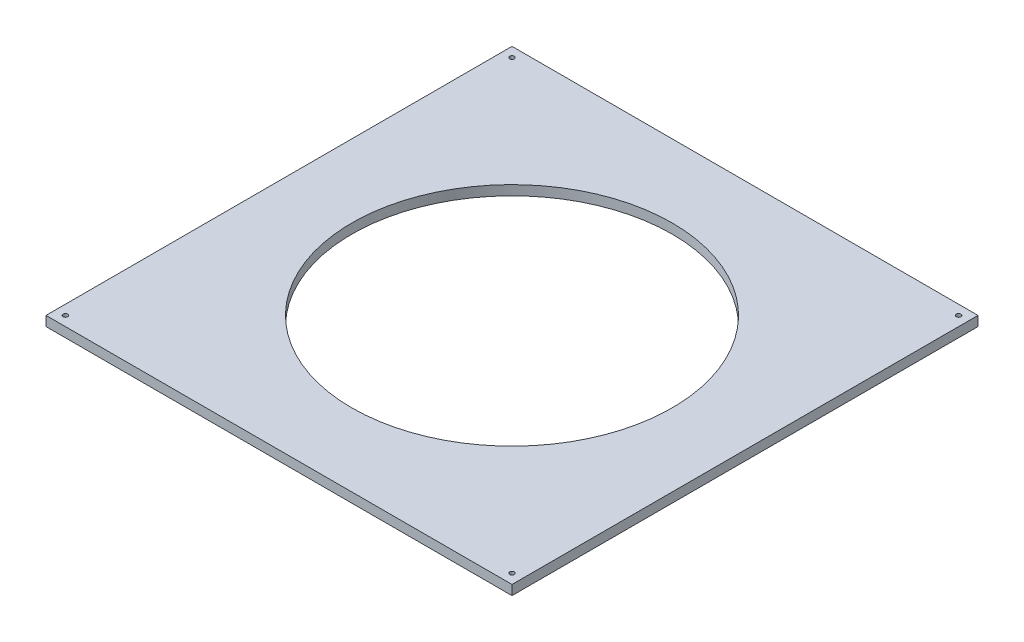
ISO-10303-21;
HEADER;
FILE_DESCRIPTION(('STEP AP214'),'2;1');
FILE_NAME('part.step','',(''),(''),'','','');
FILE_SCHEMA(('AUTOMOTIVE_DESIGN { 1 0 10303 214 1 1 1 1 }'));
ENDSEC;
DATA;
#1=APPLICATION_CONTEXT('core data for automotive mechanical design processes');
#2=APPLICATION_PROTOCOL_DEFINITION('international standard','automotive_design',2000,#1);
#3=PRODUCT_CONTEXT('',#1,'mechanical');
#4=PRODUCT('Part','Part','',(#3));
#5=PRODUCT_RELATED_PRODUCT_CATEGORY('part','',(#4));
#6=PRODUCT_DEFINITION_FORMATION('','',#4);
#7=PRODUCT_DEFINITION_CONTEXT('part definition',#1,'design');
#8=PRODUCT_DEFINITION('design','',#6,#7);
#9=PRODUCT_DEFINITION_SHAPE('','',#8);
#10=(LENGTH_UNIT() NAMED_UNIT(*) SI_UNIT(.MILLI.,.METRE.));
#11=(NAMED_UNIT(*) PLANE_ANGLE_UNIT() SI_UNIT($,.RADIAN.));
#12=(NAMED_UNIT(*) SI_UNIT($,.STERADIAN.) SOLID_ANGLE_UNIT());
#13=UNCERTAINTY_MEASURE_WITH_UNIT(LENGTH_MEASURE(1.E-05),#10,'distance_accuracy_value','');
#14=(GEOMETRIC_REPRESENTATION_CONTEXT(3) GLOBAL_UNCERTAINTY_ASSIGNED_CONTEXT((#13)) GLOBAL_UNIT_ASSIGNED_CONTEXT((#10,
#11,#12)) REPRESENTATION_CONTEXT('',''));
#15=CARTESIAN_POINT('',(0.,0.,0.));
#16=DIRECTION('',(0.,0.,1.));
#17=DIRECTION('',(1.,0.,0.));
#18=AXIS2_PLACEMENT_3D('',#15,#16,#17);
#19=CARTESIAN_POINT('',(-50.5057346041975,12.7,-44.459273419188));
#20=DIRECTION('',(1.,0.,0.));
#21=DIRECTION('',(0.,0.,-1.));
#22=AXIS2_PLACEMENT_3D('',#19,#20,#21);
#23=PLANE('',#22);
#24=DIRECTION('',(0.,0.,1.));
#25=VECTOR('',#24,1.);
#26=CARTESIAN_POINT('',(-50.5057346041975,0.,-44.459273419188));
#27=LINE('',#26,#25);
#28=CARTESIAN_POINT('',(-50.5057346041975,0.,-44.459273419188));
#29=VERTEX_POINT('',#28);
#30=CARTESIAN_POINT('',(-50.5057346041974,0.,565.140726580812));
#31=VERTEX_POINT('',#30);
#32=EDGE_CURVE('E93',#29,#31,#27,.T.);
#33=ORIENTED_EDGE('',*,*,#32,.T.);
#34=DIRECTION('',(0.,-1.,0.));
#35=VECTOR('',#34,1.);
#36=CARTESIAN_POINT('',(-50.5057346041974,12.7,565.140726580812));
#37=LINE('',#36,#35);
#38=CARTESIAN_POINT('',(-50.5057346041974,12.7,565.140726580812));
#39=VERTEX_POINT('',#38);
#40=EDGE_CURVE('E11',#39,#31,#37,.T.);
#41=ORIENTED_EDGE('',*,*,#40,.F.);
#42=DIRECTION('',(0.,0.,1.));
#43=VECTOR('',#42,1.);
#44=CARTESIAN_POINT('',(-50.5057346041975,12.7,-44.459273419188));
#45=LINE('',#44,#43);
#46=CARTESIAN_POINT('',(-50.5057346041975,12.7,-44.459273419188));
#47=VERTEX_POINT('',#46);
#48=EDGE_CURVE('E81',#47,#39,#45,.T.);
#49=ORIENTED_EDGE('',*,*,#48,.F.);
#50=DIRECTION('',(0.,-1.,0.));
#51=VECTOR('',#50,1.);
#52=CARTESIAN_POINT('',(-50.5057346041975,12.7,-44.459273419188));
#53=LINE('',#52,#51);
#54=EDGE_CURVE('E89',#47,#29,#53,.T.);
#55=ORIENTED_EDGE('',*,*,#54,.T.);
#56=EDGE_LOOP('',(#33,#41,#49,#55));
#57=FACE_BOUND('',#56,.T.);
#58=ADVANCED_FACE('F30',(#57),#23,.F.);
#59=CARTESIAN_POINT('',(-50.5057346041974,12.7,565.140726580812));
#60=DIRECTION('',(0.,0.,-1.));
#61=DIRECTION('',(-1.,0.,0.));
#62=AXIS2_PLACEMENT_3D('',#59,#60,#61);
#63=PLANE('',#62);
#64=DIRECTION('',(1.,0.,0.));
#65=VECTOR('',#64,1.);
#66=CARTESIAN_POINT('',(-50.5057346041974,0.,565.140726580812));
#67=LINE('',#66,#65);
#68=CARTESIAN_POINT('',(559.094265395803,0.,565.140726580812));
#69=VERTEX_POINT('',#68);
#70=EDGE_CURVE('E85',#31,#69,#67,.T.);
#71=ORIENTED_EDGE('',*,*,#70,.T.);
#72=DIRECTION('',(0.,-1.,0.));
#73=VECTOR('',#72,1.);
#74=CARTESIAN_POINT('',(559.094265395803,12.7,565.140726580812));
#75=LINE('',#74,#73);
#76=CARTESIAN_POINT('',(559.094265395803,12.7,565.140726580812));
#77=VERTEX_POINT('',#76);
#78=EDGE_CURVE('E38',#77,#69,#75,.T.);
#79=ORIENTED_EDGE('',*,*,#78,.F.);
#80=DIRECTION('',(1.,0.,0.));
#81=VECTOR('',#80,1.);
#82=CARTESIAN_POINT('',(-50.5057346041974,12.7,565.140726580812));
#83=LINE('',#82,#81);
#84=EDGE_CURVE('E76',#39,#77,#83,.T.);
#85=ORIENTED_EDGE('',*,*,#84,.F.);
#86=ORIENTED_EDGE('',*,*,#40,.T.);
#87=EDGE_LOOP('',(#71,#79,#85,#86));
#88=FACE_BOUND('',#87,.T.);
#89=ADVANCED_FACE('F84',(#88),#63,.F.);
#90=CARTESIAN_POINT('',(559.094265395802,12.7,-44.459273419188));
#91=DIRECTION('',(-1.,0.,0.));
#92=DIRECTION('',(0.,0.,1.));
#93=AXIS2_PLACEMENT_3D('',#90,#91,#92);
#94=PLANE('',#93);
#95=DIRECTION('',(0.,0.,-1.));
#96=VECTOR('',#95,1.);
#97=CARTESIAN_POINT('',(559.094265395802,0.,-44.459273419188));
#98=LINE('',#97,#96);
#99=CARTESIAN_POINT('',(559.094265395802,0.,-44.459273419188));
#100=VERTEX_POINT('',#99);
#101=EDGE_CURVE('E63',#69,#100,#98,.T.);
#102=ORIENTED_EDGE('',*,*,#101,.T.);
#103=DIRECTION('',(0.,-1.,0.));
#104=VECTOR('',#103,1.);
#105=CARTESIAN_POINT('',(559.094265395802,12.7,-44.459273419188));
#106=LINE('',#105,#104);
#107=CARTESIAN_POINT('',(559.094265395802,12.7,-44.459273419188));
#108=VERTEX_POINT('',#107);
#109=EDGE_CURVE('E86',#108,#100,#106,.T.);
#110=ORIENTED_EDGE('',*,*,#109,.F.);
#111=DIRECTION('',(0.,0.,-1.));
#112=VECTOR('',#111,1.);
#113=CARTESIAN_POINT('',(559.094265395802,12.7,-44.459273419188));
#114=LINE('',#113,#112);
#115=EDGE_CURVE('E79',#77,#108,#114,.T.);
#116=ORIENTED_EDGE('',*,*,#115,.F.);
#117=ORIENTED_EDGE('',*,*,#78,.T.);
#118=EDGE_LOOP('',(#102,#110,#116,#117));
#119=FACE_BOUND('',#118,.T.);
#120=ADVANCED_FACE('F87',(#119),#94,.F.);
#121=CARTESIAN_POINT('',(-50.5057346041975,12.7,-44.459273419188));
#122=DIRECTION('',(0.,0.,1.));
#123=DIRECTION('',(1.,0.,0.));
#124=AXIS2_PLACEMENT_3D('',#121,#122,#123);
#125=PLANE('',#124);
#126=DIRECTION('',(-1.,0.,0.));
#127=VECTOR('',#126,1.);
#128=CARTESIAN_POINT('',(-50.5057346041975,0.,-44.459273419188));
#129=LINE('',#128,#127);
#130=EDGE_CURVE('E69',#100,#29,#129,.T.);
#131=ORIENTED_EDGE('',*,*,#130,.T.);
#132=ORIENTED_EDGE('',*,*,#54,.F.);
#133=DIRECTION('',(-1.,0.,0.));
#134=VECTOR('',#133,1.);
#135=CARTESIAN_POINT('',(-50.5057346041975,12.7,-44.459273419188));
#136=LINE('',#135,#134);
#137=EDGE_CURVE('E46',#108,#47,#136,.T.);
#138=ORIENTED_EDGE('',*,*,#137,.F.);
#139=ORIENTED_EDGE('',*,*,#109,.T.);
#140=EDGE_LOOP('',(#131,#132,#138,#139));
#141=FACE_BOUND('',#140,.T.);
#142=ADVANCED_FACE('F101',(#141),#125,.F.);
#143=CARTESIAN_POINT('',(-50.5057346041974,12.7,565.140726580812));
#144=DIRECTION('',(0.,1.,0.));
#145=DIRECTION('',(0.,0.,1.));
#146=AXIS2_PLACEMENT_3D('',#143,#144,#145);
#147=PLANE('',#146);
#148=CARTESIAN_POINT('',(-37.8057346041975,12.7,-31.759273419188));
#149=DIRECTION('',(0.,-1.,0.));
#150=DIRECTION('',(0.,0.,-1.));
#151=AXIS2_PLACEMENT_3D('',#148,#149,#150);
#152=CIRCLE('',#151,3.);
#153=CARTESIAN_POINT('',(-37.8057346041975,12.7,-34.759273419188));
#154=VERTEX_POINT('',#153);
#155=EDGE_CURVE('E128',#154,#154,#152,.T.);
#156=ORIENTED_EDGE('',*,*,#155,.T.);
#157=EDGE_LOOP('',(#156));
#158=FACE_BOUND('',#157,.T.);
#159=CARTESIAN_POINT('',(546.394265395803,12.7,-31.7592734191879));
#160=DIRECTION('',(0.,-1.,0.));
#161=DIRECTION('',(0.,0.,-1.));
#162=AXIS2_PLACEMENT_3D('',#159,#160,#161);
#163=CIRCLE('',#162,3.00000000000005);
#164=CARTESIAN_POINT('',(546.394265395803,12.7,-34.759273419188));
#165=VERTEX_POINT('',#164);
#166=EDGE_CURVE('E122',#165,#165,#163,.T.);
#167=ORIENTED_EDGE('',*,*,#166,.T.);
#168=EDGE_LOOP('',(#167));
#169=FACE_BOUND('',#168,.T.);
#170=CARTESIAN_POINT('',(546.394265395803,12.7,552.440726580812));
#171=DIRECTION('',(0.,-1.,0.));
#172=DIRECTION('',(0.,0.,-1.));
#173=AXIS2_PLACEMENT_3D('',#170,#171,#172);
#174=CIRCLE('',#173,3.00000000000005);
#175=CARTESIAN_POINT('',(546.394265395803,12.7,549.440726580812));
#176=VERTEX_POINT('',#175);
#177=EDGE_CURVE('E116',#176,#176,#174,.T.);
#178=ORIENTED_EDGE('',*,*,#177,.T.);
#179=EDGE_LOOP('',(#178));
#180=FACE_BOUND('',#179,.T.);
#181=CARTESIAN_POINT('',(-37.8057346041975,12.7,552.440726580812));
#182=DIRECTION('',(0.,-1.,0.));
#183=DIRECTION('',(0.,0.,-1.));
#184=AXIS2_PLACEMENT_3D('',#181,#182,#183);
#185=CIRCLE('',#184,3.);
#186=CARTESIAN_POINT('',(-37.8057346041975,12.7,549.440726580812));
#187=VERTEX_POINT('',#186);
#188=EDGE_CURVE('E110',#187,#187,#185,.T.);
#189=ORIENTED_EDGE('',*,*,#188,.T.);
#190=EDGE_LOOP('',(#189));
#191=FACE_BOUND('',#190,.T.);
#192=CARTESIAN_POINT('',(254.294265395802,12.7,260.340726580812));
#193=DIRECTION('',(0.,1.,0.));
#194=DIRECTION('',(0.,0.,1.));
#195=AXIS2_PLACEMENT_3D('',#192,#193,#194);
#196=CIRCLE('',#195,209.55);
#197=CARTESIAN_POINT('',(254.294265395802,12.7,469.890726580812));
#198=VERTEX_POINT('',#197);
#199=EDGE_CURVE('E107',#198,#198,#196,.T.);
#200=ORIENTED_EDGE('',*,*,#199,.F.);
#201=EDGE_LOOP('',(#200));
#202=FACE_BOUND('',#201,.T.);
#203=ORIENTED_EDGE('',*,*,#48,.T.);
#204=ORIENTED_EDGE('',*,*,#84,.T.);
#205=ORIENTED_EDGE('',*,*,#115,.T.);
#206=ORIENTED_EDGE('',*,*,#137,.T.);
#207=EDGE_LOOP('',(#203,#204,#205,#206));
#208=FACE_BOUND('',#207,.T.);
#209=ADVANCED_FACE('F77',(#158,#169,#180,#191,#202,#208),#147,.T.);
#210=CARTESIAN_POINT('',(-50.5057346041974,0.,565.140726580812));
#211=DIRECTION('',(0.,1.,0.));
#212=DIRECTION('',(0.,0.,1.));
#213=AXIS2_PLACEMENT_3D('',#210,#211,#212);
#214=PLANE('',#213);
#215=CARTESIAN_POINT('',(-37.8057346041975,0.,-31.759273419188));
#216=DIRECTION('',(0.,-1.,0.));
#217=DIRECTION('',(0.,0.,-1.));
#218=AXIS2_PLACEMENT_3D('',#215,#216,#217);
#219=CIRCLE('',#218,3.);
#220=CARTESIAN_POINT('',(-37.8057346041975,0.,-34.759273419188));
#221=VERTEX_POINT('',#220);
#222=EDGE_CURVE('E131',#221,#221,#219,.T.);
#223=ORIENTED_EDGE('',*,*,#222,.F.);
#224=EDGE_LOOP('',(#223));
#225=FACE_BOUND('',#224,.T.);
#226=CARTESIAN_POINT('',(546.394265395803,0.,-31.7592734191879));
#227=DIRECTION('',(0.,-1.,0.));
#228=DIRECTION('',(0.,0.,-1.));
#229=AXIS2_PLACEMENT_3D('',#226,#227,#228);
#230=CIRCLE('',#229,3.00000000000005);
#231=CARTESIAN_POINT('',(546.394265395803,0.,-34.759273419188));
#232=VERTEX_POINT('',#231);
#233=EDGE_CURVE('E125',#232,#232,#230,.T.);
#234=ORIENTED_EDGE('',*,*,#233,.F.);
#235=EDGE_LOOP('',(#234));
#236=FACE_BOUND('',#235,.T.);
#237=CARTESIAN_POINT('',(546.394265395803,0.,552.440726580812));
#238=DIRECTION('',(0.,-1.,0.));
#239=DIRECTION('',(0.,0.,-1.));
#240=AXIS2_PLACEMENT_3D('',#237,#238,#239);
#241=CIRCLE('',#240,3.00000000000005);
#242=CARTESIAN_POINT('',(546.394265395803,0.,549.440726580812));
#243=VERTEX_POINT('',#242);
#244=EDGE_CURVE('E119',#243,#243,#241,.T.);
#245=ORIENTED_EDGE('',*,*,#244,.F.);
#246=EDGE_LOOP('',(#245));
#247=FACE_BOUND('',#246,.T.);
#248=CARTESIAN_POINT('',(-37.8057346041975,0.,552.440726580812));
#249=DIRECTION('',(0.,-1.,0.));
#250=DIRECTION('',(0.,0.,-1.));
#251=AXIS2_PLACEMENT_3D('',#248,#249,#250);
#252=CIRCLE('',#251,3.);
#253=CARTESIAN_POINT('',(-37.8057346041975,0.,549.440726580812));
#254=VERTEX_POINT('',#253);
#255=EDGE_CURVE('E113',#254,#254,#252,.T.);
#256=ORIENTED_EDGE('',*,*,#255,.F.);
#257=EDGE_LOOP('',(#256));
#258=FACE_BOUND('',#257,.T.);
#259=CARTESIAN_POINT('',(254.294265395802,0.,260.340726580812));
#260=DIRECTION('',(0.,1.,0.));
#261=DIRECTION('',(0.,0.,1.));
#262=AXIS2_PLACEMENT_3D('',#259,#260,#261);
#263=CIRCLE('',#262,209.55);
#264=CARTESIAN_POINT('',(254.294265395802,0.,469.890726580812));
#265=VERTEX_POINT('',#264);
#266=EDGE_CURVE('E96',#265,#265,#263,.T.);
#267=ORIENTED_EDGE('',*,*,#266,.T.);
#268=EDGE_LOOP('',(#267));
#269=FACE_BOUND('',#268,.T.);
#270=ORIENTED_EDGE('',*,*,#32,.F.);
#271=ORIENTED_EDGE('',*,*,#130,.F.);
#272=ORIENTED_EDGE('',*,*,#101,.F.);
#273=ORIENTED_EDGE('',*,*,#70,.F.);
#274=EDGE_LOOP('',(#270,#271,#272,#273));
#275=FACE_BOUND('',#274,.T.);
#276=ADVANCED_FACE('F104',(#225,#236,#247,#258,#269,#275),#214,.F.);
#277=CARTESIAN_POINT('',(254.294265395802,0.,260.340726580812));
#278=DIRECTION('',(0.,1.,0.));
#279=DIRECTION('',(0.,0.,1.));
#280=AXIS2_PLACEMENT_3D('',#277,#278,#279);
#281=CYLINDRICAL_SURFACE('',#280,209.55);
#282=ORIENTED_EDGE('',*,*,#266,.F.);
#283=EDGE_LOOP('',(#282));
#284=FACE_BOUND('',#283,.T.);
#285=ORIENTED_EDGE('',*,*,#199,.T.);
#286=EDGE_LOOP('',(#285));
#287=FACE_BOUND('',#286,.T.);
#288=ADVANCED_FACE('F148',(#284,#287),#281,.F.);
#289=CARTESIAN_POINT('',(-37.8057346041975,12.7,552.440726580812));
#290=DIRECTION('',(0.,-1.,0.));
#291=DIRECTION('',(0.,0.,-1.));
#292=AXIS2_PLACEMENT_3D('',#289,#290,#291);
#293=CYLINDRICAL_SURFACE('',#292,3.);
#294=ORIENTED_EDGE('',*,*,#188,.F.);
#295=EDGE_LOOP('',(#294));
#296=FACE_BOUND('',#295,.T.);
#297=ORIENTED_EDGE('',*,*,#255,.T.);
#298=EDGE_LOOP('',(#297));
#299=FACE_BOUND('',#298,.T.);
#300=ADVANCED_FACE('F160',(#296,#299),#293,.F.);
#301=CARTESIAN_POINT('',(546.394265395803,12.7,552.440726580812));
#302=DIRECTION('',(0.,-1.,0.));
#303=DIRECTION('',(0.,0.,-1.));
#304=AXIS2_PLACEMENT_3D('',#301,#302,#303);
#305=CYLINDRICAL_SURFACE('',#304,3.00000000000005);
#306=ORIENTED_EDGE('',*,*,#177,.F.);
#307=EDGE_LOOP('',(#306));
#308=FACE_BOUND('',#307,.T.);
#309=ORIENTED_EDGE('',*,*,#244,.T.);
#310=EDGE_LOOP('',(#309));
#311=FACE_BOUND('',#310,.T.);
#312=ADVANCED_FACE('F209',(#308,#311),#305,.F.);
#313=CARTESIAN_POINT('',(546.394265395803,12.7,-31.7592734191879));
#314=DIRECTION('',(0.,-1.,0.));
#315=DIRECTION('',(0.,0.,-1.));
#316=AXIS2_PLACEMENT_3D('',#313,#314,#315);
#317=CYLINDRICAL_SURFACE('',#316,3.00000000000005);
#318=ORIENTED_EDGE('',*,*,#166,.F.);
#319=EDGE_LOOP('',(#318));
#320=FACE_BOUND('',#319,.T.);
#321=ORIENTED_EDGE('',*,*,#233,.T.);
#322=EDGE_LOOP('',(#321));
#323=FACE_BOUND('',#322,.T.);
#324=ADVANCED_FACE('F142',(#320,#323),#317,.F.);
#325=CARTESIAN_POINT('',(-37.8057346041975,12.7,-31.759273419188));
#326=DIRECTION('',(0.,-1.,0.));
#327=DIRECTION('',(0.,0.,-1.));
#328=AXIS2_PLACEMENT_3D('',#325,#326,#327);
#329=CYLINDRICAL_SURFACE('',#328,3.);
#330=ORIENTED_EDGE('',*,*,#155,.F.);
#331=EDGE_LOOP('',(#330));
#332=FACE_BOUND('',#331,.T.);
#333=ORIENTED_EDGE('',*,*,#222,.T.);
#334=EDGE_LOOP('',(#333));
#335=FACE_BOUND('',#334,.T.);
#336=ADVANCED_FACE('F139',(#332,#335),#329,.F.);
#337=CLOSED_SHELL('',(#58,#89,#120,#142,#209,#276,#288,#300,#312,#324,#336));
#338=MANIFOLD_SOLID_BREP('B2',#337);
#339=ADVANCED_BREP_SHAPE_REPRESENTATION('',(#18,#338),#14);
#340=SHAPE_DEFINITION_REPRESENTATION(#9,#339);
ENDSEC;
END-ISO-10303-21;
